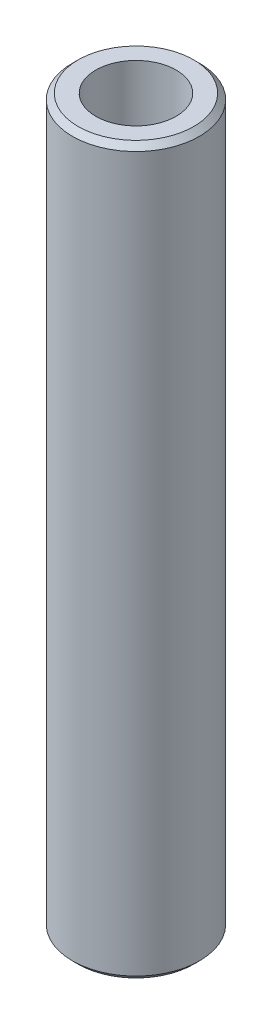
ISO-10303-21;
HEADER;
FILE_DESCRIPTION(('STEP AP214'),'2;1');
FILE_NAME('part.step','',(''),(''),'','','');
FILE_SCHEMA(('AUTOMOTIVE_DESIGN { 1 0 10303 214 1 1 1 1 }'));
ENDSEC;
DATA;
#1=APPLICATION_CONTEXT('core data for automotive mechanical design processes');
#2=APPLICATION_PROTOCOL_DEFINITION('international standard','automotive_design',2000,#1);
#3=PRODUCT_CONTEXT('',#1,'mechanical');
#4=PRODUCT('Part','Part','',(#3));
#5=PRODUCT_RELATED_PRODUCT_CATEGORY('part','',(#4));
#6=PRODUCT_DEFINITION_FORMATION('','',#4);
#7=PRODUCT_DEFINITION_CONTEXT('part definition',#1,'design');
#8=PRODUCT_DEFINITION('design','',#6,#7);
#9=PRODUCT_DEFINITION_SHAPE('','',#8);
#10=(LENGTH_UNIT() NAMED_UNIT(*) SI_UNIT(.MILLI.,.METRE.));
#11=(NAMED_UNIT(*) PLANE_ANGLE_UNIT() SI_UNIT($,.RADIAN.));
#12=(NAMED_UNIT(*) SI_UNIT($,.STERADIAN.) SOLID_ANGLE_UNIT());
#13=UNCERTAINTY_MEASURE_WITH_UNIT(LENGTH_MEASURE(1.E-05),#10,'distance_accuracy_value','');
#14=(GEOMETRIC_REPRESENTATION_CONTEXT(3) GLOBAL_UNCERTAINTY_ASSIGNED_CONTEXT((#13)) GLOBAL_UNIT_ASSIGNED_CONTEXT((#10,
#11,#12)) REPRESENTATION_CONTEXT('',''));
#15=CARTESIAN_POINT('',(0.,0.,0.));
#16=DIRECTION('',(0.,0.,1.));
#17=DIRECTION('',(1.,0.,0.));
#18=AXIS2_PLACEMENT_3D('',#15,#16,#17);
#19=CARTESIAN_POINT('',(0.,600.,0.));
#20=DIRECTION('',(0.,-1.,0.));
#21=DIRECTION('',(0.,0.,-1.));
#22=AXIS2_PLACEMENT_3D('',#19,#20,#21);
#23=CYLINDRICAL_SURFACE('',#22,52.5);
#24=CARTESIAN_POINT('',(0.,595.30097746975,0.));
#25=DIRECTION('',(0.,1.,0.));
#26=DIRECTION('',(0.,0.,1.));
#27=AXIS2_PLACEMENT_3D('',#24,#25,#26);
#28=CIRCLE('',#27,52.5);
#29=CARTESIAN_POINT('',(0.,595.30097746975,52.5));
#30=VERTEX_POINT('',#29);
#31=EDGE_CURVE('E50',#30,#30,#28,.F.);
#32=ORIENTED_EDGE('',*,*,#31,.T.);
#33=EDGE_LOOP('',(#32));
#34=FACE_BOUND('',#33,.T.);
#35=CARTESIAN_POINT('',(0.,4.69902253024967,0.));
#36=DIRECTION('',(0.,1.,0.));
#37=DIRECTION('',(0.,0.,1.));
#38=AXIS2_PLACEMENT_3D('',#35,#36,#37);
#39=CIRCLE('',#38,52.5);
#40=CARTESIAN_POINT('',(0.,4.69902253024967,52.5));
#41=VERTEX_POINT('',#40);
#42=EDGE_CURVE('E51',#41,#41,#39,.T.);
#43=ORIENTED_EDGE('',*,*,#42,.T.);
#44=EDGE_LOOP('',(#43));
#45=FACE_BOUND('',#44,.T.);
#46=ADVANCED_FACE('F39',(#34,#45),#23,.T.);
#47=CARTESIAN_POINT('',(0.,600.,0.));
#48=DIRECTION('',(0.,1.,0.));
#49=DIRECTION('',(0.,0.,1.));
#50=AXIS2_PLACEMENT_3D('',#47,#48,#49);
#51=PLANE('',#50);
#52=CARTESIAN_POINT('',(0.,600.,0.));
#53=DIRECTION('',(0.,1.,0.));
#54=DIRECTION('',(0.,0.,1.));
#55=AXIS2_PLACEMENT_3D('',#52,#53,#54);
#56=CIRCLE('',#55,47.8009774697504);
#57=CARTESIAN_POINT('',(0.,600.,47.8009774697504));
#58=VERTEX_POINT('',#57);
#59=EDGE_CURVE('E54',#58,#58,#56,.T.);
#60=ORIENTED_EDGE('',*,*,#59,.T.);
#61=EDGE_LOOP('',(#60));
#62=FACE_BOUND('',#61,.T.);
#63=CARTESIAN_POINT('',(0.,600.,0.));
#64=DIRECTION('',(0.,1.,0.));
#65=DIRECTION('',(0.,0.,1.));
#66=AXIS2_PLACEMENT_3D('',#63,#64,#65);
#67=CIRCLE('',#66,33.2126434159238);
#68=CARTESIAN_POINT('',(0.,600.,33.2126434159238));
#69=VERTEX_POINT('',#68);
#70=EDGE_CURVE('E58',#69,#69,#67,.T.);
#71=ORIENTED_EDGE('',*,*,#70,.F.);
#72=EDGE_LOOP('',(#71));
#73=FACE_BOUND('',#72,.T.);
#74=ADVANCED_FACE('F69',(#62,#73),#51,.T.);
#75=CARTESIAN_POINT('',(0.,0.,0.));
#76=DIRECTION('',(0.,1.,0.));
#77=DIRECTION('',(0.,0.,1.));
#78=AXIS2_PLACEMENT_3D('',#75,#76,#77);
#79=PLANE('',#78);
#80=CARTESIAN_POINT('',(0.,0.,0.));
#81=DIRECTION('',(0.,1.,0.));
#82=DIRECTION('',(0.,0.,1.));
#83=AXIS2_PLACEMENT_3D('',#80,#81,#82);
#84=CIRCLE('',#83,47.8009774697503);
#85=CARTESIAN_POINT('',(0.,0.,47.8009774697503));
#86=VERTEX_POINT('',#85);
#87=EDGE_CURVE('E10',#86,#86,#84,.F.);
#88=ORIENTED_EDGE('',*,*,#87,.T.);
#89=EDGE_LOOP('',(#88));
#90=FACE_BOUND('',#89,.T.);
#91=CARTESIAN_POINT('',(0.,0.,0.));
#92=DIRECTION('',(0.,1.,0.));
#93=DIRECTION('',(0.,0.,1.));
#94=AXIS2_PLACEMENT_3D('',#91,#92,#93);
#95=CIRCLE('',#94,33.2126434159238);
#96=CARTESIAN_POINT('',(0.,0.,33.2126434159238));
#97=VERTEX_POINT('',#96);
#98=EDGE_CURVE('E63',#97,#97,#95,.T.);
#99=ORIENTED_EDGE('',*,*,#98,.T.);
#100=EDGE_LOOP('',(#99));
#101=FACE_BOUND('',#100,.T.);
#102=ADVANCED_FACE('F75',(#90,#101),#79,.F.);
#103=CARTESIAN_POINT('',(0.,600.,0.));
#104=DIRECTION('',(0.,-1.,0.));
#105=DIRECTION('',(0.,0.,-1.));
#106=AXIS2_PLACEMENT_3D('',#103,#104,#105);
#107=CYLINDRICAL_SURFACE('',#106,33.2126434159238);
#108=ORIENTED_EDGE('',*,*,#70,.T.);
#109=EDGE_LOOP('',(#108));
#110=FACE_BOUND('',#109,.T.);
#111=ORIENTED_EDGE('',*,*,#98,.F.);
#112=EDGE_LOOP('',(#111));
#113=FACE_BOUND('',#112,.T.);
#114=ADVANCED_FACE('F70',(#110,#113),#107,.F.);
#115=CARTESIAN_POINT('',(0.,600.,0.));
#116=DIRECTION('',(0.,-1.,0.));
#117=DIRECTION('',(0.,0.,-1.));
#118=AXIS2_PLACEMENT_3D('',#115,#116,#117);
#119=CONICAL_SURFACE('',#118,47.8009774697504,0.785398163397443);
#120=ORIENTED_EDGE('',*,*,#31,.F.);
#121=EDGE_LOOP('',(#120));
#122=FACE_BOUND('',#121,.T.);
#123=ORIENTED_EDGE('',*,*,#59,.F.);
#124=EDGE_LOOP('',(#123));
#125=FACE_BOUND('',#124,.T.);
#126=ADVANCED_FACE('F81',(#122,#125),#119,.T.);
#127=CARTESIAN_POINT('',(0.,4.69902253024967,0.));
#128=DIRECTION('',(0.,1.,0.));
#129=DIRECTION('',(0.,0.,1.));
#130=AXIS2_PLACEMENT_3D('',#127,#128,#129);
#131=CONICAL_SURFACE('',#130,52.5,0.785398163397449);
#132=ORIENTED_EDGE('',*,*,#87,.F.);
#133=EDGE_LOOP('',(#132));
#134=FACE_BOUND('',#133,.T.);
#135=ORIENTED_EDGE('',*,*,#42,.F.);
#136=EDGE_LOOP('',(#135));
#137=FACE_BOUND('',#136,.T.);
#138=ADVANCED_FACE('F45',(#134,#137),#131,.T.);
#139=CLOSED_SHELL('',(#46,#74,#102,#114,#126,#138));
#140=MANIFOLD_SOLID_BREP('B2',#139);
#141=ADVANCED_BREP_SHAPE_REPRESENTATION('',(#18,#140),#14);
#142=SHAPE_DEFINITION_REPRESENTATION(#9,#141);
ENDSEC;
END-ISO-10303-21;
